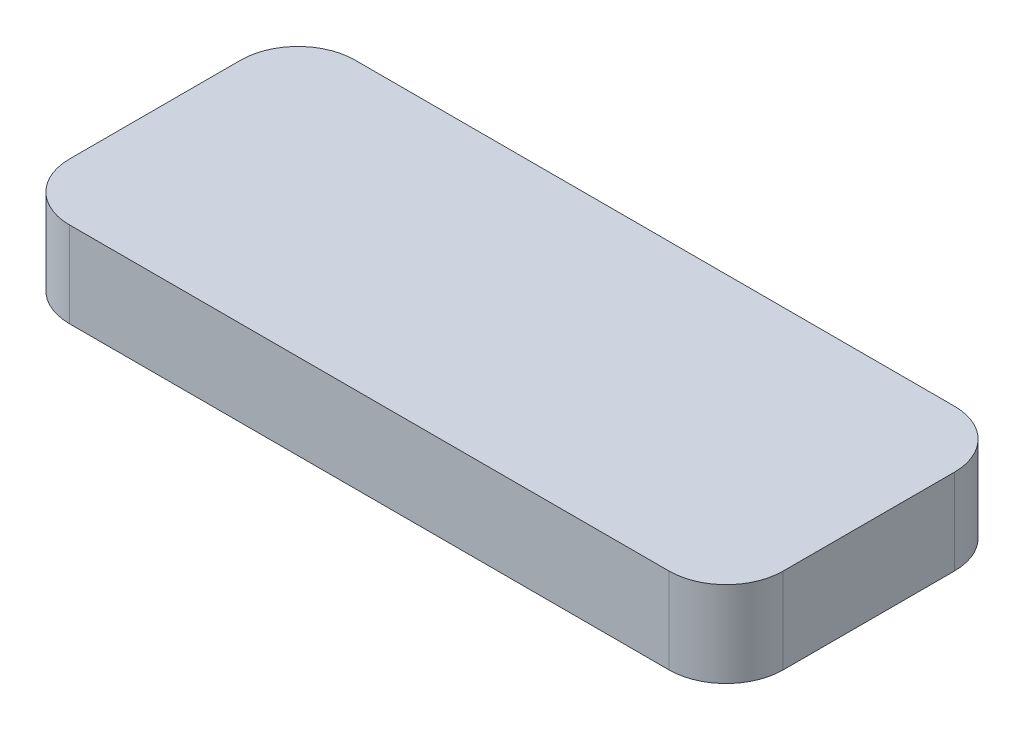
ISO-10303-21;
HEADER;
FILE_DESCRIPTION(('STEP AP214'),'2;1');
FILE_NAME('part.step','',(''),(''),'','','');
FILE_SCHEMA(('AUTOMOTIVE_DESIGN { 1 0 10303 214 1 1 1 1 }'));
ENDSEC;
DATA;
#1=APPLICATION_CONTEXT('core data for automotive mechanical design processes');
#2=APPLICATION_PROTOCOL_DEFINITION('international standard','automotive_design',2000,#1);
#3=PRODUCT_CONTEXT('',#1,'mechanical');
#4=PRODUCT('Part','Part','',(#3));
#5=PRODUCT_RELATED_PRODUCT_CATEGORY('part','',(#4));
#6=PRODUCT_DEFINITION_FORMATION('','',#4);
#7=PRODUCT_DEFINITION_CONTEXT('part definition',#1,'design');
#8=PRODUCT_DEFINITION('design','',#6,#7);
#9=PRODUCT_DEFINITION_SHAPE('','',#8);
#10=(LENGTH_UNIT() NAMED_UNIT(*) SI_UNIT(.MILLI.,.METRE.));
#11=(NAMED_UNIT(*) PLANE_ANGLE_UNIT() SI_UNIT($,.RADIAN.));
#12=(NAMED_UNIT(*) SI_UNIT($,.STERADIAN.) SOLID_ANGLE_UNIT());
#13=UNCERTAINTY_MEASURE_WITH_UNIT(LENGTH_MEASURE(1.E-05),#10,'distance_accuracy_value','');
#14=(GEOMETRIC_REPRESENTATION_CONTEXT(3) GLOBAL_UNCERTAINTY_ASSIGNED_CONTEXT((#13)) GLOBAL_UNIT_ASSIGNED_CONTEXT((#10,
#11,#12)) REPRESENTATION_CONTEXT('',''));
#15=CARTESIAN_POINT('',(0.,0.,0.));
#16=DIRECTION('',(0.,0.,1.));
#17=DIRECTION('',(1.,0.,0.));
#18=AXIS2_PLACEMENT_3D('',#15,#16,#17);
#19=CARTESIAN_POINT('',(-12.5,3.,5.));
#20=DIRECTION('',(1.,0.,0.));
#21=DIRECTION('',(0.,0.,-1.));
#22=AXIS2_PLACEMENT_3D('',#19,#20,#21);
#23=PLANE('',#22);
#24=DIRECTION('',(0.,0.,1.));
#25=VECTOR('',#24,1.);
#26=CARTESIAN_POINT('',(-12.5,3.,5.));
#27=LINE('',#26,#25);
#28=CARTESIAN_POINT('',(-12.5,3.,-3.));
#29=VERTEX_POINT('',#28);
#30=CARTESIAN_POINT('',(-12.5,3.,3.));
#31=VERTEX_POINT('',#30);
#32=EDGE_CURVE('E123',#29,#31,#27,.T.);
#33=ORIENTED_EDGE('',*,*,#32,.F.);
#34=DIRECTION('',(0.,-1.,0.));
#35=VECTOR('',#34,1.);
#36=CARTESIAN_POINT('',(-12.5,3.,-3.));
#37=LINE('',#36,#35);
#38=CARTESIAN_POINT('',(-12.5,0.,-3.));
#39=VERTEX_POINT('',#38);
#40=EDGE_CURVE('E108',#29,#39,#37,.T.);
#41=ORIENTED_EDGE('',*,*,#40,.T.);
#42=DIRECTION('',(0.,0.,1.));
#43=VECTOR('',#42,1.);
#44=CARTESIAN_POINT('',(-12.5,0.,5.));
#45=LINE('',#44,#43);
#46=CARTESIAN_POINT('',(-12.5,0.,3.));
#47=VERTEX_POINT('',#46);
#48=EDGE_CURVE('E120',#39,#47,#45,.T.);
#49=ORIENTED_EDGE('',*,*,#48,.T.);
#50=DIRECTION('',(0.,-1.,0.));
#51=VECTOR('',#50,1.);
#52=CARTESIAN_POINT('',(-12.5,3.,3.));
#53=LINE('',#52,#51);
#54=EDGE_CURVE('E125',#47,#31,#53,.F.);
#55=ORIENTED_EDGE('',*,*,#54,.T.);
#56=EDGE_LOOP('',(#33,#41,#49,#55));
#57=FACE_BOUND('',#56,.T.);
#58=ADVANCED_FACE('F37',(#57),#23,.F.);
#59=CARTESIAN_POINT('',(12.5,3.,5.));
#60=DIRECTION('',(0.,0.,-1.));
#61=DIRECTION('',(-1.,0.,0.));
#62=AXIS2_PLACEMENT_3D('',#59,#60,#61);
#63=PLANE('',#62);
#64=DIRECTION('',(1.,0.,0.));
#65=VECTOR('',#64,1.);
#66=CARTESIAN_POINT('',(12.5,3.,5.));
#67=LINE('',#66,#65);
#68=CARTESIAN_POINT('',(-10.5,3.,5.));
#69=VERTEX_POINT('',#68);
#70=CARTESIAN_POINT('',(10.5,3.,5.));
#71=VERTEX_POINT('',#70);
#72=EDGE_CURVE('E163',#69,#71,#67,.T.);
#73=ORIENTED_EDGE('',*,*,#72,.F.);
#74=DIRECTION('',(0.,-1.,0.));
#75=VECTOR('',#74,1.);
#76=CARTESIAN_POINT('',(-10.5,3.,5.));
#77=LINE('',#76,#75);
#78=CARTESIAN_POINT('',(-10.5,0.,5.));
#79=VERTEX_POINT('',#78);
#80=EDGE_CURVE('E11',#69,#79,#77,.T.);
#81=ORIENTED_EDGE('',*,*,#80,.T.);
#82=DIRECTION('',(1.,0.,0.));
#83=VECTOR('',#82,1.);
#84=CARTESIAN_POINT('',(12.5,0.,5.));
#85=LINE('',#84,#83);
#86=CARTESIAN_POINT('',(10.5,0.,5.));
#87=VERTEX_POINT('',#86);
#88=EDGE_CURVE('E130',#79,#87,#85,.T.);
#89=ORIENTED_EDGE('',*,*,#88,.T.);
#90=DIRECTION('',(0.,-1.,0.));
#91=VECTOR('',#90,1.);
#92=CARTESIAN_POINT('',(10.5,3.,5.));
#93=LINE('',#92,#91);
#94=EDGE_CURVE('E45',#87,#71,#93,.F.);
#95=ORIENTED_EDGE('',*,*,#94,.T.);
#96=EDGE_LOOP('',(#73,#81,#89,#95));
#97=FACE_BOUND('',#96,.T.);
#98=ADVANCED_FACE('F162',(#97),#63,.F.);
#99=CARTESIAN_POINT('',(12.5,3.,5.));
#100=DIRECTION('',(-1.,0.,0.));
#101=DIRECTION('',(0.,0.,1.));
#102=AXIS2_PLACEMENT_3D('',#99,#100,#101);
#103=PLANE('',#102);
#104=DIRECTION('',(0.,0.,-1.));
#105=VECTOR('',#104,1.);
#106=CARTESIAN_POINT('',(12.5,0.,5.));
#107=LINE('',#106,#105);
#108=CARTESIAN_POINT('',(12.5,0.,3.));
#109=VERTEX_POINT('',#108);
#110=CARTESIAN_POINT('',(12.5,0.,-3.));
#111=VERTEX_POINT('',#110);
#112=EDGE_CURVE('E133',#109,#111,#107,.T.);
#113=ORIENTED_EDGE('',*,*,#112,.T.);
#114=DIRECTION('',(0.,-1.,0.));
#115=VECTOR('',#114,1.);
#116=CARTESIAN_POINT('',(12.5,3.,-3.));
#117=LINE('',#116,#115);
#118=CARTESIAN_POINT('',(12.5,3.,-3.));
#119=VERTEX_POINT('',#118);
#120=EDGE_CURVE('E52',#111,#119,#117,.F.);
#121=ORIENTED_EDGE('',*,*,#120,.T.);
#122=DIRECTION('',(0.,0.,-1.));
#123=VECTOR('',#122,1.);
#124=CARTESIAN_POINT('',(12.5,3.,5.));
#125=LINE('',#124,#123);
#126=CARTESIAN_POINT('',(12.5,3.,3.));
#127=VERTEX_POINT('',#126);
#128=EDGE_CURVE('E169',#127,#119,#125,.T.);
#129=ORIENTED_EDGE('',*,*,#128,.F.);
#130=DIRECTION('',(0.,-1.,0.));
#131=VECTOR('',#130,1.);
#132=CARTESIAN_POINT('',(12.5,3.,3.));
#133=LINE('',#132,#131);
#134=EDGE_CURVE('E156',#127,#109,#133,.T.);
#135=ORIENTED_EDGE('',*,*,#134,.T.);
#136=EDGE_LOOP('',(#113,#121,#129,#135));
#137=FACE_BOUND('',#136,.T.);
#138=ADVANCED_FACE('F173',(#137),#103,.F.);
#139=CARTESIAN_POINT('',(12.5,3.,-5.));
#140=DIRECTION('',(0.,0.,1.));
#141=DIRECTION('',(1.,0.,0.));
#142=AXIS2_PLACEMENT_3D('',#139,#140,#141);
#143=PLANE('',#142);
#144=DIRECTION('',(-1.,0.,0.));
#145=VECTOR('',#144,1.);
#146=CARTESIAN_POINT('',(12.5,0.,-5.));
#147=LINE('',#146,#145);
#148=CARTESIAN_POINT('',(10.5,0.,-5.));
#149=VERTEX_POINT('',#148);
#150=CARTESIAN_POINT('',(-10.5,0.,-5.));
#151=VERTEX_POINT('',#150);
#152=EDGE_CURVE('E140',#149,#151,#147,.T.);
#153=ORIENTED_EDGE('',*,*,#152,.T.);
#154=DIRECTION('',(0.,-1.,0.));
#155=VECTOR('',#154,1.);
#156=CARTESIAN_POINT('',(-10.5,3.,-5.));
#157=LINE('',#156,#155);
#158=CARTESIAN_POINT('',(-10.5,3.,-5.));
#159=VERTEX_POINT('',#158);
#160=EDGE_CURVE('E109',#151,#159,#157,.F.);
#161=ORIENTED_EDGE('',*,*,#160,.T.);
#162=DIRECTION('',(-1.,0.,0.));
#163=VECTOR('',#162,1.);
#164=CARTESIAN_POINT('',(12.5,3.,-5.));
#165=LINE('',#164,#163);
#166=CARTESIAN_POINT('',(10.5,3.,-5.));
#167=VERTEX_POINT('',#166);
#168=EDGE_CURVE('E136',#167,#159,#165,.T.);
#169=ORIENTED_EDGE('',*,*,#168,.F.);
#170=DIRECTION('',(0.,-1.,0.));
#171=VECTOR('',#170,1.);
#172=CARTESIAN_POINT('',(10.5,3.,-5.));
#173=LINE('',#172,#171);
#174=EDGE_CURVE('E114',#167,#149,#173,.T.);
#175=ORIENTED_EDGE('',*,*,#174,.T.);
#176=EDGE_LOOP('',(#153,#161,#169,#175));
#177=FACE_BOUND('',#176,.T.);
#178=ADVANCED_FACE('F180',(#177),#143,.F.);
#179=CARTESIAN_POINT('',(0.,3.,0.));
#180=DIRECTION('',(0.,1.,0.));
#181=DIRECTION('',(0.,0.,1.));
#182=AXIS2_PLACEMENT_3D('',#179,#180,#181);
#183=PLANE('',#182);
#184=ORIENTED_EDGE('',*,*,#168,.T.);
#185=CARTESIAN_POINT('',(-10.5,3.,-3.));
#186=DIRECTION('',(0.,1.,0.));
#187=DIRECTION('',(0.,0.,1.));
#188=AXIS2_PLACEMENT_3D('',#185,#186,#187);
#189=CIRCLE('',#188,2.);
#190=EDGE_CURVE('E154',#159,#29,#189,.T.);
#191=ORIENTED_EDGE('',*,*,#190,.T.);
#192=ORIENTED_EDGE('',*,*,#32,.T.);
#193=CARTESIAN_POINT('',(-10.5,3.,3.));
#194=DIRECTION('',(0.,1.,0.));
#195=DIRECTION('',(0.,0.,1.));
#196=AXIS2_PLACEMENT_3D('',#193,#194,#195);
#197=CIRCLE('',#196,2.);
#198=EDGE_CURVE('E150',#31,#69,#197,.T.);
#199=ORIENTED_EDGE('',*,*,#198,.T.);
#200=ORIENTED_EDGE('',*,*,#72,.T.);
#201=CARTESIAN_POINT('',(10.5,3.,3.));
#202=DIRECTION('',(0.,1.,0.));
#203=DIRECTION('',(0.,0.,1.));
#204=AXIS2_PLACEMENT_3D('',#201,#202,#203);
#205=CIRCLE('',#204,2.);
#206=EDGE_CURVE('E59',#71,#127,#205,.T.);
#207=ORIENTED_EDGE('',*,*,#206,.T.);
#208=ORIENTED_EDGE('',*,*,#128,.T.);
#209=CARTESIAN_POINT('',(10.5,3.,-3.));
#210=DIRECTION('',(0.,1.,0.));
#211=DIRECTION('',(0.,0.,1.));
#212=AXIS2_PLACEMENT_3D('',#209,#210,#211);
#213=CIRCLE('',#212,2.);
#214=EDGE_CURVE('E152',#119,#167,#213,.T.);
#215=ORIENTED_EDGE('',*,*,#214,.T.);
#216=EDGE_LOOP('',(#184,#191,#192,#199,#200,#207,#208,#215));
#217=FACE_BOUND('',#216,.T.);
#218=ADVANCED_FACE('F167',(#217),#183,.T.);
#219=CARTESIAN_POINT('',(0.,0.,0.));
#220=DIRECTION('',(0.,1.,0.));
#221=DIRECTION('',(0.,0.,1.));
#222=AXIS2_PLACEMENT_3D('',#219,#220,#221);
#223=PLANE('',#222);
#224=ORIENTED_EDGE('',*,*,#48,.F.);
#225=CARTESIAN_POINT('',(-10.5,0.,-3.));
#226=DIRECTION('',(0.,1.,0.));
#227=DIRECTION('',(0.,0.,1.));
#228=AXIS2_PLACEMENT_3D('',#225,#226,#227);
#229=CIRCLE('',#228,2.);
#230=EDGE_CURVE('E104',#39,#151,#229,.F.);
#231=ORIENTED_EDGE('',*,*,#230,.T.);
#232=ORIENTED_EDGE('',*,*,#152,.F.);
#233=CARTESIAN_POINT('',(10.5,0.,-3.));
#234=DIRECTION('',(0.,1.,0.));
#235=DIRECTION('',(0.,0.,1.));
#236=AXIS2_PLACEMENT_3D('',#233,#234,#235);
#237=CIRCLE('',#236,2.);
#238=EDGE_CURVE('E115',#149,#111,#237,.F.);
#239=ORIENTED_EDGE('',*,*,#238,.T.);
#240=ORIENTED_EDGE('',*,*,#112,.F.);
#241=CARTESIAN_POINT('',(10.5,0.,3.));
#242=DIRECTION('',(0.,1.,0.));
#243=DIRECTION('',(0.,0.,1.));
#244=AXIS2_PLACEMENT_3D('',#241,#242,#243);
#245=CIRCLE('',#244,2.);
#246=EDGE_CURVE('E124',#109,#87,#245,.F.);
#247=ORIENTED_EDGE('',*,*,#246,.T.);
#248=ORIENTED_EDGE('',*,*,#88,.F.);
#249=CARTESIAN_POINT('',(-10.5,0.,3.));
#250=DIRECTION('',(0.,1.,0.));
#251=DIRECTION('',(0.,0.,1.));
#252=AXIS2_PLACEMENT_3D('',#249,#250,#251);
#253=CIRCLE('',#252,2.);
#254=EDGE_CURVE('E129',#79,#47,#253,.F.);
#255=ORIENTED_EDGE('',*,*,#254,.T.);
#256=EDGE_LOOP('',(#224,#231,#232,#239,#240,#247,#248,#255));
#257=FACE_BOUND('',#256,.T.);
#258=ADVANCED_FACE('F127',(#257),#223,.F.);
#259=CARTESIAN_POINT('',(-10.5,3.,-3.));
#260=DIRECTION('',(0.,-1.,0.));
#261=DIRECTION('',(0.,0.,-1.));
#262=AXIS2_PLACEMENT_3D('',#259,#260,#261);
#263=CYLINDRICAL_SURFACE('',#262,2.);
#264=ORIENTED_EDGE('',*,*,#190,.F.);
#265=ORIENTED_EDGE('',*,*,#160,.F.);
#266=ORIENTED_EDGE('',*,*,#230,.F.);
#267=ORIENTED_EDGE('',*,*,#40,.F.);
#268=EDGE_LOOP('',(#264,#265,#266,#267));
#269=FACE_BOUND('',#268,.T.);
#270=ADVANCED_FACE('F107',(#269),#263,.T.);
#271=CARTESIAN_POINT('',(10.5,3.,-3.));
#272=DIRECTION('',(0.,-1.,0.));
#273=DIRECTION('',(0.,0.,-1.));
#274=AXIS2_PLACEMENT_3D('',#271,#272,#273);
#275=CYLINDRICAL_SURFACE('',#274,2.);
#276=ORIENTED_EDGE('',*,*,#214,.F.);
#277=ORIENTED_EDGE('',*,*,#120,.F.);
#278=ORIENTED_EDGE('',*,*,#238,.F.);
#279=ORIENTED_EDGE('',*,*,#174,.F.);
#280=EDGE_LOOP('',(#276,#277,#278,#279));
#281=FACE_BOUND('',#280,.T.);
#282=ADVANCED_FACE('F177',(#281),#275,.T.);
#283=CARTESIAN_POINT('',(-10.5,3.,3.));
#284=DIRECTION('',(0.,-1.,0.));
#285=DIRECTION('',(0.,0.,-1.));
#286=AXIS2_PLACEMENT_3D('',#283,#284,#285);
#287=CYLINDRICAL_SURFACE('',#286,2.);
#288=ORIENTED_EDGE('',*,*,#198,.F.);
#289=ORIENTED_EDGE('',*,*,#54,.F.);
#290=ORIENTED_EDGE('',*,*,#254,.F.);
#291=ORIENTED_EDGE('',*,*,#80,.F.);
#292=EDGE_LOOP('',(#288,#289,#290,#291));
#293=FACE_BOUND('',#292,.T.);
#294=ADVANCED_FACE('F183',(#293),#287,.T.);
#295=CARTESIAN_POINT('',(10.5,3.,3.));
#296=DIRECTION('',(0.,-1.,0.));
#297=DIRECTION('',(0.,0.,-1.));
#298=AXIS2_PLACEMENT_3D('',#295,#296,#297);
#299=CYLINDRICAL_SURFACE('',#298,2.);
#300=ORIENTED_EDGE('',*,*,#206,.F.);
#301=ORIENTED_EDGE('',*,*,#94,.F.);
#302=ORIENTED_EDGE('',*,*,#246,.F.);
#303=ORIENTED_EDGE('',*,*,#134,.F.);
#304=EDGE_LOOP('',(#300,#301,#302,#303));
#305=FACE_BOUND('',#304,.T.);
#306=ADVANCED_FACE('F39',(#305),#299,.T.);
#307=CLOSED_SHELL('',(#58,#98,#138,#178,#218,#258,#270,#282,#294,#306));
#308=MANIFOLD_SOLID_BREP('B2',#307);
#309=ADVANCED_BREP_SHAPE_REPRESENTATION('',(#18,#308),#14);
#310=SHAPE_DEFINITION_REPRESENTATION(#9,#309);
ENDSEC;
END-ISO-10303-21;
